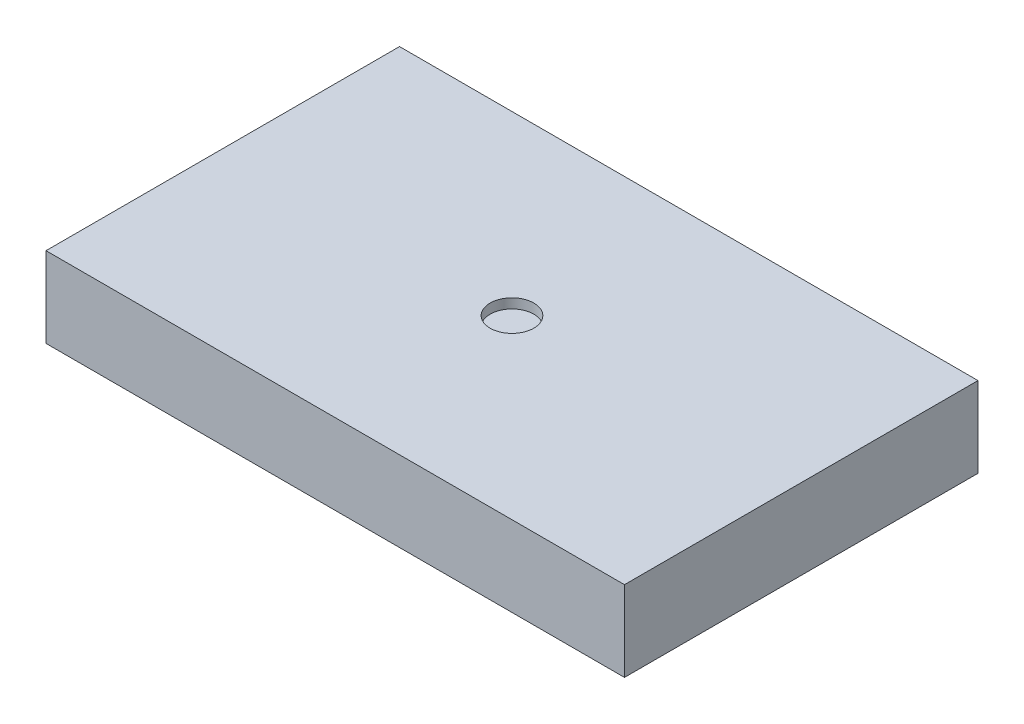
ISO-10303-21;
HEADER;
FILE_DESCRIPTION(('STEP AP214'),'2;1');
FILE_NAME('part.step','',(''),(''),'','','');
FILE_SCHEMA(('AUTOMOTIVE_DESIGN { 1 0 10303 214 1 1 1 1 }'));
ENDSEC;
DATA;
#1=APPLICATION_CONTEXT('core data for automotive mechanical design processes');
#2=APPLICATION_PROTOCOL_DEFINITION('international standard','automotive_design',2000,#1);
#3=PRODUCT_CONTEXT('',#1,'mechanical');
#4=PRODUCT('Part','Part','',(#3));
#5=PRODUCT_RELATED_PRODUCT_CATEGORY('part','',(#4));
#6=PRODUCT_DEFINITION_FORMATION('','',#4);
#7=PRODUCT_DEFINITION_CONTEXT('part definition',#1,'design');
#8=PRODUCT_DEFINITION('design','',#6,#7);
#9=PRODUCT_DEFINITION_SHAPE('','',#8);
#10=(LENGTH_UNIT() NAMED_UNIT(*) SI_UNIT(.MILLI.,.METRE.));
#11=(NAMED_UNIT(*) PLANE_ANGLE_UNIT() SI_UNIT($,.RADIAN.));
#12=(NAMED_UNIT(*) SI_UNIT($,.STERADIAN.) SOLID_ANGLE_UNIT());
#13=UNCERTAINTY_MEASURE_WITH_UNIT(LENGTH_MEASURE(1.E-05),#10,'distance_accuracy_value','');
#14=(GEOMETRIC_REPRESENTATION_CONTEXT(3) GLOBAL_UNCERTAINTY_ASSIGNED_CONTEXT((#13)) GLOBAL_UNIT_ASSIGNED_CONTEXT((#10,
#11,#12)) REPRESENTATION_CONTEXT('',''));
#15=CARTESIAN_POINT('',(0.,0.,0.));
#16=DIRECTION('',(0.,0.,1.));
#17=DIRECTION('',(1.,0.,0.));
#18=AXIS2_PLACEMENT_3D('',#15,#16,#17);
#19=CARTESIAN_POINT('',(22.86,6.35,13.97));
#20=DIRECTION('',(-1.,0.,0.));
#21=DIRECTION('',(0.,0.,1.));
#22=AXIS2_PLACEMENT_3D('',#19,#20,#21);
#23=PLANE('',#22);
#24=DIRECTION('',(0.,0.,-1.));
#25=VECTOR('',#24,1.);
#26=CARTESIAN_POINT('',(22.86,0.,13.97));
#27=LINE('',#26,#25);
#28=CARTESIAN_POINT('',(22.86,0.,13.97));
#29=VERTEX_POINT('',#28);
#30=CARTESIAN_POINT('',(22.86,0.,-13.97));
#31=VERTEX_POINT('',#30);
#32=EDGE_CURVE('E96',#29,#31,#27,.T.);
#33=ORIENTED_EDGE('',*,*,#32,.T.);
#34=DIRECTION('',(0.,-1.,0.));
#35=VECTOR('',#34,1.);
#36=CARTESIAN_POINT('',(22.86,6.35,-13.97));
#37=LINE('',#36,#35);
#38=CARTESIAN_POINT('',(22.86,6.35,-13.97));
#39=VERTEX_POINT('',#38);
#40=EDGE_CURVE('E11',#39,#31,#37,.T.);
#41=ORIENTED_EDGE('',*,*,#40,.F.);
#42=DIRECTION('',(0.,0.,-1.));
#43=VECTOR('',#42,1.);
#44=CARTESIAN_POINT('',(22.86,6.35,13.97));
#45=LINE('',#44,#43);
#46=CARTESIAN_POINT('',(22.86,6.35,13.97));
#47=VERTEX_POINT('',#46);
#48=EDGE_CURVE('E84',#47,#39,#45,.T.);
#49=ORIENTED_EDGE('',*,*,#48,.F.);
#50=DIRECTION('',(0.,-1.,0.));
#51=VECTOR('',#50,1.);
#52=CARTESIAN_POINT('',(22.86,6.35,13.97));
#53=LINE('',#52,#51);
#54=EDGE_CURVE('E92',#47,#29,#53,.T.);
#55=ORIENTED_EDGE('',*,*,#54,.T.);
#56=EDGE_LOOP('',(#33,#41,#49,#55));
#57=FACE_BOUND('',#56,.T.);
#58=ADVANCED_FACE('F33',(#57),#23,.F.);
#59=CARTESIAN_POINT('',(-22.86,6.35,-13.97));
#60=DIRECTION('',(0.,0.,1.));
#61=DIRECTION('',(1.,0.,0.));
#62=AXIS2_PLACEMENT_3D('',#59,#60,#61);
#63=PLANE('',#62);
#64=DIRECTION('',(-1.,0.,0.));
#65=VECTOR('',#64,1.);
#66=CARTESIAN_POINT('',(-22.86,0.,-13.97));
#67=LINE('',#66,#65);
#68=CARTESIAN_POINT('',(-22.86,0.,-13.97));
#69=VERTEX_POINT('',#68);
#70=EDGE_CURVE('E88',#31,#69,#67,.T.);
#71=ORIENTED_EDGE('',*,*,#70,.T.);
#72=DIRECTION('',(0.,-1.,0.));
#73=VECTOR('',#72,1.);
#74=CARTESIAN_POINT('',(-22.86,6.35,-13.97));
#75=LINE('',#74,#73);
#76=CARTESIAN_POINT('',(-22.86,6.35,-13.97));
#77=VERTEX_POINT('',#76);
#78=EDGE_CURVE('E41',#77,#69,#75,.T.);
#79=ORIENTED_EDGE('',*,*,#78,.F.);
#80=DIRECTION('',(-1.,0.,0.));
#81=VECTOR('',#80,1.);
#82=CARTESIAN_POINT('',(-22.86,6.35,-13.97));
#83=LINE('',#82,#81);
#84=EDGE_CURVE('E79',#39,#77,#83,.T.);
#85=ORIENTED_EDGE('',*,*,#84,.F.);
#86=ORIENTED_EDGE('',*,*,#40,.T.);
#87=EDGE_LOOP('',(#71,#79,#85,#86));
#88=FACE_BOUND('',#87,.T.);
#89=ADVANCED_FACE('F87',(#88),#63,.F.);
#90=CARTESIAN_POINT('',(-22.86,6.35,13.97));
#91=DIRECTION('',(1.,0.,0.));
#92=DIRECTION('',(0.,0.,-1.));
#93=AXIS2_PLACEMENT_3D('',#90,#91,#92);
#94=PLANE('',#93);
#95=DIRECTION('',(0.,0.,1.));
#96=VECTOR('',#95,1.);
#97=CARTESIAN_POINT('',(-22.86,0.,13.97));
#98=LINE('',#97,#96);
#99=CARTESIAN_POINT('',(-22.86,0.,13.97));
#100=VERTEX_POINT('',#99);
#101=EDGE_CURVE('E66',#69,#100,#98,.T.);
#102=ORIENTED_EDGE('',*,*,#101,.T.);
#103=DIRECTION('',(0.,-1.,0.));
#104=VECTOR('',#103,1.);
#105=CARTESIAN_POINT('',(-22.86,6.35,13.97));
#106=LINE('',#105,#104);
#107=CARTESIAN_POINT('',(-22.86,6.35,13.97));
#108=VERTEX_POINT('',#107);
#109=EDGE_CURVE('E89',#108,#100,#106,.T.);
#110=ORIENTED_EDGE('',*,*,#109,.F.);
#111=DIRECTION('',(0.,0.,1.));
#112=VECTOR('',#111,1.);
#113=CARTESIAN_POINT('',(-22.86,6.35,13.97));
#114=LINE('',#113,#112);
#115=EDGE_CURVE('E82',#77,#108,#114,.T.);
#116=ORIENTED_EDGE('',*,*,#115,.F.);
#117=ORIENTED_EDGE('',*,*,#78,.T.);
#118=EDGE_LOOP('',(#102,#110,#116,#117));
#119=FACE_BOUND('',#118,.T.);
#120=ADVANCED_FACE('F90',(#119),#94,.F.);
#121=CARTESIAN_POINT('',(-22.86,6.35,13.97));
#122=DIRECTION('',(0.,0.,-1.));
#123=DIRECTION('',(-1.,0.,0.));
#124=AXIS2_PLACEMENT_3D('',#121,#122,#123);
#125=PLANE('',#124);
#126=DIRECTION('',(1.,0.,0.));
#127=VECTOR('',#126,1.);
#128=CARTESIAN_POINT('',(-22.86,0.,13.97));
#129=LINE('',#128,#127);
#130=EDGE_CURVE('E72',#100,#29,#129,.T.);
#131=ORIENTED_EDGE('',*,*,#130,.T.);
#132=ORIENTED_EDGE('',*,*,#54,.F.);
#133=DIRECTION('',(1.,0.,0.));
#134=VECTOR('',#133,1.);
#135=CARTESIAN_POINT('',(-22.86,6.35,13.97));
#136=LINE('',#135,#134);
#137=EDGE_CURVE('E49',#108,#47,#136,.T.);
#138=ORIENTED_EDGE('',*,*,#137,.F.);
#139=ORIENTED_EDGE('',*,*,#109,.T.);
#140=EDGE_LOOP('',(#131,#132,#138,#139));
#141=FACE_BOUND('',#140,.T.);
#142=ADVANCED_FACE('F104',(#141),#125,.F.);
#143=CARTESIAN_POINT('',(0.,6.35,0.));
#144=DIRECTION('',(0.,-1.,0.));
#145=DIRECTION('',(0.,0.,-1.));
#146=AXIS2_PLACEMENT_3D('',#143,#144,#145);
#147=PLANE('',#146);
#148=CARTESIAN_POINT('',(0.,6.35,0.));
#149=DIRECTION('',(0.,1.,0.));
#150=DIRECTION('',(0.,0.,1.));
#151=AXIS2_PLACEMENT_3D('',#148,#149,#150);
#152=CIRCLE('',#151,1.72484372558611);
#153=CARTESIAN_POINT('',(0.,6.35,1.72484372558611));
#154=VERTEX_POINT('',#153);
#155=EDGE_CURVE('E110',#154,#154,#152,.T.);
#156=ORIENTED_EDGE('',*,*,#155,.F.);
#157=EDGE_LOOP('',(#156));
#158=FACE_BOUND('',#157,.T.);
#159=ORIENTED_EDGE('',*,*,#48,.T.);
#160=ORIENTED_EDGE('',*,*,#84,.T.);
#161=ORIENTED_EDGE('',*,*,#115,.T.);
#162=ORIENTED_EDGE('',*,*,#137,.T.);
#163=EDGE_LOOP('',(#159,#160,#161,#162));
#164=FACE_BOUND('',#163,.T.);
#165=ADVANCED_FACE('F80',(#158,#164),#147,.F.);
#166=CARTESIAN_POINT('',(0.,0.,0.));
#167=DIRECTION('',(0.,-1.,0.));
#168=DIRECTION('',(0.,0.,-1.));
#169=AXIS2_PLACEMENT_3D('',#166,#167,#168);
#170=PLANE('',#169);
#171=ORIENTED_EDGE('',*,*,#32,.F.);
#172=ORIENTED_EDGE('',*,*,#130,.F.);
#173=ORIENTED_EDGE('',*,*,#101,.F.);
#174=ORIENTED_EDGE('',*,*,#70,.F.);
#175=EDGE_LOOP('',(#171,#172,#173,#174));
#176=FACE_BOUND('',#175,.T.);
#177=ADVANCED_FACE('F107',(#176),#170,.T.);
#178=CARTESIAN_POINT('',(0.,5.588,0.));
#179=DIRECTION('',(0.,1.,0.));
#180=DIRECTION('',(0.,0.,1.));
#181=AXIS2_PLACEMENT_3D('',#178,#179,#180);
#182=CYLINDRICAL_SURFACE('',#181,1.72484372558611);
#183=CARTESIAN_POINT('',(0.,5.588,0.));
#184=DIRECTION('',(0.,1.,0.));
#185=DIRECTION('',(0.,0.,1.));
#186=AXIS2_PLACEMENT_3D('',#183,#184,#185);
#187=CIRCLE('',#186,1.72484372558611);
#188=CARTESIAN_POINT('',(0.,5.588,1.72484372558611));
#189=VERTEX_POINT('',#188);
#190=EDGE_CURVE('E99',#189,#189,#187,.T.);
#191=ORIENTED_EDGE('',*,*,#190,.F.);
#192=EDGE_LOOP('',(#191));
#193=FACE_BOUND('',#192,.T.);
#194=ORIENTED_EDGE('',*,*,#155,.T.);
#195=EDGE_LOOP('',(#194));
#196=FACE_BOUND('',#195,.T.);
#197=ADVANCED_FACE('F118',(#193,#196),#182,.F.);
#198=CARTESIAN_POINT('',(0.,5.588,0.));
#199=DIRECTION('',(0.,1.,0.));
#200=DIRECTION('',(0.,0.,1.));
#201=AXIS2_PLACEMENT_3D('',#198,#199,#200);
#202=PLANE('',#201);
#203=ORIENTED_EDGE('',*,*,#190,.T.);
#204=EDGE_LOOP('',(#203));
#205=FACE_BOUND('',#204,.T.);
#206=ADVANCED_FACE('F116',(#205),#202,.T.);
#207=CLOSED_SHELL('',(#58,#89,#120,#142,#165,#177,#197,#206));
#208=MANIFOLD_SOLID_BREP('B2',#207);
#209=ADVANCED_BREP_SHAPE_REPRESENTATION('',(#18,#208),#14);
#210=SHAPE_DEFINITION_REPRESENTATION(#9,#209);
ENDSEC;
END-ISO-10303-21;
